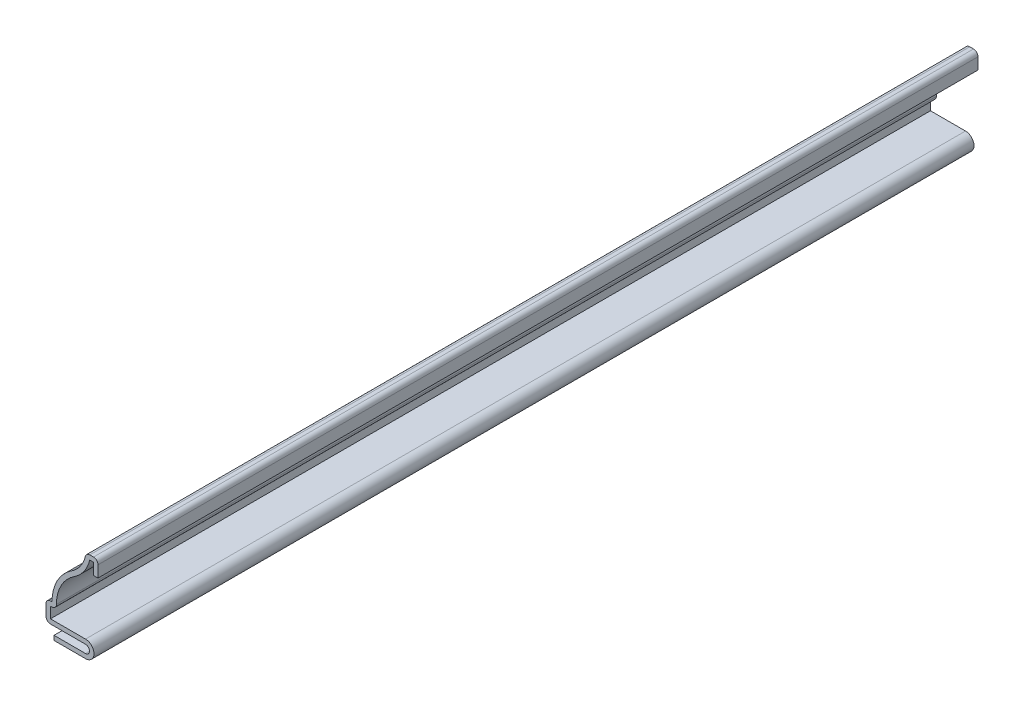
ISO-10303-21;
HEADER;
FILE_DESCRIPTION(('STEP AP214'),'2;1');
FILE_NAME('part.step','',(''),(''),'','','');
FILE_SCHEMA(('AUTOMOTIVE_DESIGN { 1 0 10303 214 1 1 1 1 }'));
ENDSEC;
DATA;
#1=APPLICATION_CONTEXT('core data for automotive mechanical design processes');
#2=APPLICATION_PROTOCOL_DEFINITION('international standard','automotive_design',2000,#1);
#3=PRODUCT_CONTEXT('',#1,'mechanical');
#4=PRODUCT('Part','Part','',(#3));
#5=PRODUCT_RELATED_PRODUCT_CATEGORY('part','',(#4));
#6=PRODUCT_DEFINITION_FORMATION('','',#4);
#7=PRODUCT_DEFINITION_CONTEXT('part definition',#1,'design');
#8=PRODUCT_DEFINITION('design','',#6,#7);
#9=PRODUCT_DEFINITION_SHAPE('','',#8);
#10=(LENGTH_UNIT() NAMED_UNIT(*) SI_UNIT(.MILLI.,.METRE.));
#11=(NAMED_UNIT(*) PLANE_ANGLE_UNIT() SI_UNIT($,.RADIAN.));
#12=(NAMED_UNIT(*) SI_UNIT($,.STERADIAN.) SOLID_ANGLE_UNIT());
#13=UNCERTAINTY_MEASURE_WITH_UNIT(LENGTH_MEASURE(1.E-05),#10,'distance_accuracy_value','');
#14=(GEOMETRIC_REPRESENTATION_CONTEXT(3) GLOBAL_UNCERTAINTY_ASSIGNED_CONTEXT((#13)) GLOBAL_UNIT_ASSIGNED_CONTEXT((#10,
#11,#12)) REPRESENTATION_CONTEXT('',''));
#15=CARTESIAN_POINT('',(0.,0.,0.));
#16=DIRECTION('',(0.,0.,1.));
#17=DIRECTION('',(1.,0.,0.));
#18=AXIS2_PLACEMENT_3D('',#15,#16,#17);
#19=CARTESIAN_POINT('',(-0.889,15.08125,-174.625));
#20=DIRECTION('',(0.,-1.,0.));
#21=DIRECTION('',(0.,0.,-1.));
#22=AXIS2_PLACEMENT_3D('',#19,#20,#21);
#23=PLANE('',#22);
#24=DIRECTION('',(1.,0.,0.));
#25=VECTOR('',#24,1.);
#26=CARTESIAN_POINT('',(-0.889,15.08125,0.));
#27=LINE('',#26,#25);
#28=CARTESIAN_POINT('',(-0.889,15.08125,0.));
#29=VERTEX_POINT('',#28);
#30=CARTESIAN_POINT('',(0.,15.08125,0.));
#31=VERTEX_POINT('',#30);
#32=EDGE_CURVE('E278',#29,#31,#27,.T.);
#33=ORIENTED_EDGE('',*,*,#32,.F.);
#34=DIRECTION('',(0.,0.,1.));
#35=VECTOR('',#34,1.);
#36=CARTESIAN_POINT('',(-0.889,15.08125,-174.625));
#37=LINE('',#36,#35);
#38=CARTESIAN_POINT('',(-0.889,15.08125,-174.625));
#39=VERTEX_POINT('',#38);
#40=EDGE_CURVE('E224',#39,#29,#37,.T.);
#41=ORIENTED_EDGE('',*,*,#40,.F.);
#42=DIRECTION('',(1.,0.,0.));
#43=VECTOR('',#42,1.);
#44=CARTESIAN_POINT('',(-0.889,15.08125,-174.625));
#45=LINE('',#44,#43);
#46=CARTESIAN_POINT('',(0.,15.08125,-174.625));
#47=VERTEX_POINT('',#46);
#48=EDGE_CURVE('E220',#39,#47,#45,.T.);
#49=ORIENTED_EDGE('',*,*,#48,.T.);
#50=DIRECTION('',(0.,0.,1.));
#51=VECTOR('',#50,1.);
#52=CARTESIAN_POINT('',(0.,15.08125,-174.625));
#53=LINE('',#52,#51);
#54=EDGE_CURVE('E203',#47,#31,#53,.T.);
#55=ORIENTED_EDGE('',*,*,#54,.T.);
#56=EDGE_LOOP('',(#33,#41,#49,#55));
#57=FACE_BOUND('',#56,.T.);
#58=ADVANCED_FACE('F35',(#57),#23,.T.);
#59=CARTESIAN_POINT('',(-0.889,15.08125,-174.625));
#60=DIRECTION('',(-1.,0.,0.));
#61=DIRECTION('',(0.,0.,1.));
#62=AXIS2_PLACEMENT_3D('',#59,#60,#61);
#63=PLANE('',#62);
#64=DIRECTION('',(0.,-1.,0.));
#65=VECTOR('',#64,1.);
#66=CARTESIAN_POINT('',(-0.889,15.08125,0.));
#67=LINE('',#66,#65);
#68=CARTESIAN_POINT('',(-0.889,17.36725,0.));
#69=VERTEX_POINT('',#68);
#70=EDGE_CURVE('E225',#69,#29,#67,.T.);
#71=ORIENTED_EDGE('',*,*,#70,.F.);
#72=DIRECTION('',(0.,0.,1.));
#73=VECTOR('',#72,1.);
#74=CARTESIAN_POINT('',(-0.889,17.36725,-174.625));
#75=LINE('',#74,#73);
#76=CARTESIAN_POINT('',(-0.889,17.36725,-174.625));
#77=VERTEX_POINT('',#76);
#78=EDGE_CURVE('E330',#77,#69,#75,.T.);
#79=ORIENTED_EDGE('',*,*,#78,.F.);
#80=DIRECTION('',(0.,-1.,0.));
#81=VECTOR('',#80,1.);
#82=CARTESIAN_POINT('',(-0.889,15.08125,-174.625));
#83=LINE('',#82,#81);
#84=EDGE_CURVE('E214',#77,#39,#83,.T.);
#85=ORIENTED_EDGE('',*,*,#84,.T.);
#86=ORIENTED_EDGE('',*,*,#40,.T.);
#87=EDGE_LOOP('',(#71,#79,#85,#86));
#88=FACE_BOUND('',#87,.T.);
#89=ADVANCED_FACE('F417',(#88),#63,.T.);
#90=CARTESIAN_POINT('',(-0.889,17.36725,-174.625));
#91=DIRECTION('',(0.,-1.,0.));
#92=DIRECTION('',(0.,0.,-1.));
#93=AXIS2_PLACEMENT_3D('',#90,#91,#92);
#94=PLANE('',#93);
#95=DIRECTION('',(1.,0.,0.));
#96=VECTOR('',#95,1.);
#97=CARTESIAN_POINT('',(-0.889,17.36725,0.));
#98=LINE('',#97,#96);
#99=CARTESIAN_POINT('',(-1.64074410593466,17.36725,0.));
#100=VERTEX_POINT('',#99);
#101=EDGE_CURVE('E228',#100,#69,#98,.T.);
#102=ORIENTED_EDGE('',*,*,#101,.F.);
#103=DIRECTION('',(0.,0.,1.));
#104=VECTOR('',#103,1.);
#105=CARTESIAN_POINT('',(-1.64074410593466,17.36725,-174.625));
#106=LINE('',#105,#104);
#107=CARTESIAN_POINT('',(-1.64074410593466,17.36725,-174.625));
#108=VERTEX_POINT('',#107);
#109=EDGE_CURVE('E332',#108,#100,#106,.T.);
#110=ORIENTED_EDGE('',*,*,#109,.F.);
#111=DIRECTION('',(1.,0.,0.));
#112=VECTOR('',#111,1.);
#113=CARTESIAN_POINT('',(-0.889,17.36725,-174.625));
#114=LINE('',#113,#112);
#115=EDGE_CURVE('E274',#108,#77,#114,.T.);
#116=ORIENTED_EDGE('',*,*,#115,.T.);
#117=ORIENTED_EDGE('',*,*,#78,.T.);
#118=EDGE_LOOP('',(#102,#110,#116,#117));
#119=FACE_BOUND('',#118,.T.);
#120=ADVANCED_FACE('F422',(#119),#94,.T.);
#121=CARTESIAN_POINT('',(-8.68144530947256,19.05,-174.625));
#122=DIRECTION('',(0.,0.,1.));
#123=DIRECTION('',(1.,0.,0.));
#124=AXIS2_PLACEMENT_3D('',#121,#122,#123);
#125=CYLINDRICAL_SURFACE('',#124,7.239);
#126=CARTESIAN_POINT('',(-8.68144530947256,19.05,0.));
#127=DIRECTION('',(0.,0.,1.));
#128=DIRECTION('',(-1.,0.,0.));
#129=AXIS2_PLACEMENT_3D('',#126,#127,#128);
#130=CIRCLE('',#129,7.239);
#131=CARTESIAN_POINT('',(-4.70687200890305,12.99972,0.));
#132=VERTEX_POINT('',#131);
#133=EDGE_CURVE('E323',#132,#100,#130,.T.);
#134=ORIENTED_EDGE('',*,*,#133,.F.);
#135=DIRECTION('',(0.,0.,1.));
#136=VECTOR('',#135,1.);
#137=CARTESIAN_POINT('',(-4.70687200890305,12.99972,-174.625));
#138=LINE('',#137,#136);
#139=CARTESIAN_POINT('',(-4.70687200890305,12.99972,-174.625));
#140=VERTEX_POINT('',#139);
#141=EDGE_CURVE('E334',#140,#132,#138,.T.);
#142=ORIENTED_EDGE('',*,*,#141,.F.);
#143=CARTESIAN_POINT('',(-8.68144530947256,19.05,-174.625));
#144=DIRECTION('',(0.,0.,1.));
#145=DIRECTION('',(-1.,0.,0.));
#146=AXIS2_PLACEMENT_3D('',#143,#144,#145);
#147=CIRCLE('',#146,7.239);
#148=EDGE_CURVE('E271',#140,#108,#147,.T.);
#149=ORIENTED_EDGE('',*,*,#148,.T.);
#150=ORIENTED_EDGE('',*,*,#109,.T.);
#151=EDGE_LOOP('',(#134,#142,#149,#150));
#152=FACE_BOUND('',#151,.T.);
#153=ADVANCED_FACE('F520',(#152),#125,.T.);
#154=CARTESIAN_POINT('',(-0.401084266619407,6.44525,-174.625));
#155=DIRECTION('',(0.,0.,1.));
#156=DIRECTION('',(1.,0.,0.));
#157=AXIS2_PLACEMENT_3D('',#154,#155,#156);
#158=CYLINDRICAL_SURFACE('',#157,7.84225);
#159=CARTESIAN_POINT('',(-0.401084266619407,6.44525,0.));
#160=DIRECTION('',(0.,0.,-1.));
#161=DIRECTION('',(1.,0.,0.));
#162=AXIS2_PLACEMENT_3D('',#159,#160,#161);
#163=CIRCLE('',#162,7.84225);
#164=CARTESIAN_POINT('',(-8.2433342666194,6.44525,0.));
#165=VERTEX_POINT('',#164);
#166=EDGE_CURVE('E321',#165,#132,#163,.T.);
#167=ORIENTED_EDGE('',*,*,#166,.F.);
#168=DIRECTION('',(0.,0.,1.));
#169=VECTOR('',#168,1.);
#170=CARTESIAN_POINT('',(-8.2433342666194,6.44525,-174.625));
#171=LINE('',#170,#169);
#172=CARTESIAN_POINT('',(-8.2433342666194,6.44525,-174.625));
#173=VERTEX_POINT('',#172);
#174=EDGE_CURVE('E388',#165,#173,#171,.F.);
#175=ORIENTED_EDGE('',*,*,#174,.T.);
#176=CARTESIAN_POINT('',(-0.401084266619407,6.44525,-174.625));
#177=DIRECTION('',(0.,0.,-1.));
#178=DIRECTION('',(1.,0.,0.));
#179=AXIS2_PLACEMENT_3D('',#176,#177,#178);
#180=CIRCLE('',#179,7.84225);
#181=EDGE_CURVE('E269',#173,#140,#180,.T.);
#182=ORIENTED_EDGE('',*,*,#181,.T.);
#183=ORIENTED_EDGE('',*,*,#141,.T.);
#184=EDGE_LOOP('',(#167,#175,#182,#183));
#185=FACE_BOUND('',#184,.T.);
#186=ADVANCED_FACE('F524',(#185),#158,.F.);
#187=CARTESIAN_POINT('',(-8.1927826734175,5.55625,-174.625));
#188=DIRECTION('',(0.,-1.,0.));
#189=DIRECTION('',(1.,0.,0.));
#190=AXIS2_PLACEMENT_3D('',#187,#188,#189);
#191=PLANE('',#190);
#192=DIRECTION('',(1.,0.,0.));
#193=VECTOR('',#192,1.);
#194=CARTESIAN_POINT('',(-8.1927826734175,5.55625,-174.625));
#195=LINE('',#194,#193);
#196=CARTESIAN_POINT('',(-9.42975,5.55625,-174.625));
#197=VERTEX_POINT('',#196);
#198=CARTESIAN_POINT('',(-9.13233426661941,5.55625,-174.625));
#199=VERTEX_POINT('',#198);
#200=EDGE_CURVE('E266',#197,#199,#195,.T.);
#201=ORIENTED_EDGE('',*,*,#200,.T.);
#202=DIRECTION('',(0.,0.,1.));
#203=VECTOR('',#202,1.);
#204=CARTESIAN_POINT('',(-9.13233426661941,5.55625,-174.625));
#205=LINE('',#204,#203);
#206=CARTESIAN_POINT('',(-9.13233426661941,5.55625,0.));
#207=VERTEX_POINT('',#206);
#208=EDGE_CURVE('E385',#199,#207,#205,.T.);
#209=ORIENTED_EDGE('',*,*,#208,.T.);
#210=DIRECTION('',(1.,0.,0.));
#211=VECTOR('',#210,1.);
#212=CARTESIAN_POINT('',(-8.1927826734175,5.55625,0.));
#213=LINE('',#212,#211);
#214=CARTESIAN_POINT('',(-9.42975,5.55625,0.));
#215=VERTEX_POINT('',#214);
#216=EDGE_CURVE('E318',#215,#207,#213,.T.);
#217=ORIENTED_EDGE('',*,*,#216,.F.);
#218=DIRECTION('',(0.,0.,1.));
#219=VECTOR('',#218,1.);
#220=CARTESIAN_POINT('',(-9.42975,5.55625,-174.625));
#221=LINE('',#220,#219);
#222=EDGE_CURVE('E337',#197,#215,#221,.T.);
#223=ORIENTED_EDGE('',*,*,#222,.F.);
#224=EDGE_LOOP('',(#201,#209,#217,#223));
#225=FACE_BOUND('',#224,.T.);
#226=ADVANCED_FACE('F448',(#225),#191,.T.);
#227=CARTESIAN_POINT('',(-9.42975,5.55625,-174.625));
#228=DIRECTION('',(1.,0.,0.));
#229=DIRECTION('',(0.,0.,-1.));
#230=AXIS2_PLACEMENT_3D('',#227,#228,#229);
#231=PLANE('',#230);
#232=DIRECTION('',(0.,1.,0.));
#233=VECTOR('',#232,1.);
#234=CARTESIAN_POINT('',(-9.42975,5.55625,0.));
#235=LINE('',#234,#233);
#236=CARTESIAN_POINT('',(-9.42975,3.3655,0.));
#237=VERTEX_POINT('',#236);
#238=EDGE_CURVE('E315',#237,#215,#235,.T.);
#239=ORIENTED_EDGE('',*,*,#238,.F.);
#240=DIRECTION('',(0.,0.,1.));
#241=VECTOR('',#240,1.);
#242=CARTESIAN_POINT('',(-9.42975,3.3655,-174.625));
#243=LINE('',#242,#241);
#244=CARTESIAN_POINT('',(-9.42975,3.3655,-174.625));
#245=VERTEX_POINT('',#244);
#246=EDGE_CURVE('E339',#245,#237,#243,.T.);
#247=ORIENTED_EDGE('',*,*,#246,.F.);
#248=DIRECTION('',(0.,1.,0.));
#249=VECTOR('',#248,1.);
#250=CARTESIAN_POINT('',(-9.42975,5.55625,-174.625));
#251=LINE('',#250,#249);
#252=EDGE_CURVE('E263',#245,#197,#251,.T.);
#253=ORIENTED_EDGE('',*,*,#252,.T.);
#254=ORIENTED_EDGE('',*,*,#222,.T.);
#255=EDGE_LOOP('',(#239,#247,#253,#254));
#256=FACE_BOUND('',#255,.T.);
#257=ADVANCED_FACE('F452',(#256),#231,.T.);
#258=CARTESIAN_POINT('',(-9.42975,3.3655,-174.625));
#259=DIRECTION('',(0.,1.,0.));
#260=DIRECTION('',(-1.,0.,0.));
#261=AXIS2_PLACEMENT_3D('',#258,#259,#260);
#262=PLANE('',#261);
#263=DIRECTION('',(-1.,0.,0.));
#264=VECTOR('',#263,1.);
#265=CARTESIAN_POINT('',(-9.42975,3.3655,0.));
#266=LINE('',#265,#264);
#267=CARTESIAN_POINT('',(-2.4765,3.3655,0.));
#268=VERTEX_POINT('',#267);
#269=EDGE_CURVE('E312',#268,#237,#266,.T.);
#270=ORIENTED_EDGE('',*,*,#269,.F.);
#271=DIRECTION('',(0.,0.,1.));
#272=VECTOR('',#271,1.);
#273=CARTESIAN_POINT('',(-2.4765,3.3655,-174.625));
#274=LINE('',#273,#272);
#275=CARTESIAN_POINT('',(-2.4765,3.3655,-174.625));
#276=VERTEX_POINT('',#275);
#277=EDGE_CURVE('E341',#276,#268,#274,.T.);
#278=ORIENTED_EDGE('',*,*,#277,.F.);
#279=DIRECTION('',(-1.,0.,0.));
#280=VECTOR('',#279,1.);
#281=CARTESIAN_POINT('',(-9.42975,3.3655,-174.625));
#282=LINE('',#281,#280);
#283=EDGE_CURVE('E260',#276,#245,#282,.T.);
#284=ORIENTED_EDGE('',*,*,#283,.T.);
#285=ORIENTED_EDGE('',*,*,#246,.T.);
#286=EDGE_LOOP('',(#270,#278,#284,#285));
#287=FACE_BOUND('',#286,.T.);
#288=ADVANCED_FACE('F457',(#287),#262,.T.);
#289=CARTESIAN_POINT('',(-2.4765,1.68275,-174.625));
#290=DIRECTION('',(0.,0.,1.));
#291=DIRECTION('',(1.,0.,0.));
#292=AXIS2_PLACEMENT_3D('',#289,#290,#291);
#293=CYLINDRICAL_SURFACE('',#292,1.68275);
#294=CARTESIAN_POINT('',(-2.4765,1.68275,0.));
#295=DIRECTION('',(0.,0.,1.));
#296=DIRECTION('',(-1.,0.,0.));
#297=AXIS2_PLACEMENT_3D('',#294,#295,#296);
#298=CIRCLE('',#297,1.68275);
#299=CARTESIAN_POINT('',(-2.4765,0.,0.));
#300=VERTEX_POINT('',#299);
#301=EDGE_CURVE('E309',#300,#268,#298,.T.);
#302=ORIENTED_EDGE('',*,*,#301,.F.);
#303=DIRECTION('',(0.,0.,1.));
#304=VECTOR('',#303,1.);
#305=CARTESIAN_POINT('',(-2.4765,0.,-174.625));
#306=LINE('',#305,#304);
#307=CARTESIAN_POINT('',(-2.4765,0.,-174.625));
#308=VERTEX_POINT('',#307);
#309=EDGE_CURVE('E343',#308,#300,#306,.T.);
#310=ORIENTED_EDGE('',*,*,#309,.F.);
#311=CARTESIAN_POINT('',(-2.4765,1.68275,-174.625));
#312=DIRECTION('',(0.,0.,1.));
#313=DIRECTION('',(-1.,0.,0.));
#314=AXIS2_PLACEMENT_3D('',#311,#312,#313);
#315=CIRCLE('',#314,1.68275);
#316=EDGE_CURVE('E257',#308,#276,#315,.T.);
#317=ORIENTED_EDGE('',*,*,#316,.T.);
#318=ORIENTED_EDGE('',*,*,#277,.T.);
#319=EDGE_LOOP('',(#302,#310,#317,#318));
#320=FACE_BOUND('',#319,.T.);
#321=ADVANCED_FACE('F460',(#320),#293,.T.);
#322=CARTESIAN_POINT('',(-2.4765,0.,-174.625));
#323=DIRECTION('',(0.,-1.,0.));
#324=DIRECTION('',(1.,0.,0.));
#325=AXIS2_PLACEMENT_3D('',#322,#323,#324);
#326=PLANE('',#325);
#327=DIRECTION('',(1.,0.,0.));
#328=VECTOR('',#327,1.);
#329=CARTESIAN_POINT('',(-2.4765,0.,0.));
#330=LINE('',#329,#328);
#331=CARTESIAN_POINT('',(-8.73125,0.,0.));
#332=VERTEX_POINT('',#331);
#333=EDGE_CURVE('E306',#332,#300,#330,.T.);
#334=ORIENTED_EDGE('',*,*,#333,.F.);
#335=DIRECTION('',(0.,0.,1.));
#336=VECTOR('',#335,1.);
#337=CARTESIAN_POINT('',(-8.73125,0.,-174.625));
#338=LINE('',#337,#336);
#339=CARTESIAN_POINT('',(-8.73125,0.,-174.625));
#340=VERTEX_POINT('',#339);
#341=EDGE_CURVE('E345',#340,#332,#338,.T.);
#342=ORIENTED_EDGE('',*,*,#341,.F.);
#343=DIRECTION('',(1.,0.,0.));
#344=VECTOR('',#343,1.);
#345=CARTESIAN_POINT('',(-2.4765,0.,-174.625));
#346=LINE('',#345,#344);
#347=EDGE_CURVE('E254',#340,#308,#346,.T.);
#348=ORIENTED_EDGE('',*,*,#347,.T.);
#349=ORIENTED_EDGE('',*,*,#309,.T.);
#350=EDGE_LOOP('',(#334,#342,#348,#349));
#351=FACE_BOUND('',#350,.T.);
#352=ADVANCED_FACE('F465',(#351),#326,.T.);
#353=CARTESIAN_POINT('',(-8.73125,0.,-174.625));
#354=DIRECTION('',(-1.,0.,0.));
#355=DIRECTION('',(0.,0.,1.));
#356=AXIS2_PLACEMENT_3D('',#353,#354,#355);
#357=PLANE('',#356);
#358=DIRECTION('',(0.,-1.,0.));
#359=VECTOR('',#358,1.);
#360=CARTESIAN_POINT('',(-8.73125,0.,0.));
#361=LINE('',#360,#359);
#362=CARTESIAN_POINT('',(-8.73125,0.888999999999999,0.));
#363=VERTEX_POINT('',#362);
#364=EDGE_CURVE('E303',#363,#332,#361,.T.);
#365=ORIENTED_EDGE('',*,*,#364,.F.);
#366=DIRECTION('',(0.,0.,1.));
#367=VECTOR('',#366,1.);
#368=CARTESIAN_POINT('',(-8.73125,0.888999999999999,-174.625));
#369=LINE('',#368,#367);
#370=CARTESIAN_POINT('',(-8.73125,0.888999999999999,-174.625));
#371=VERTEX_POINT('',#370);
#372=EDGE_CURVE('E347',#371,#363,#369,.T.);
#373=ORIENTED_EDGE('',*,*,#372,.F.);
#374=DIRECTION('',(0.,-1.,0.));
#375=VECTOR('',#374,1.);
#376=CARTESIAN_POINT('',(-8.73125,0.,-174.625));
#377=LINE('',#376,#375);
#378=EDGE_CURVE('E251',#371,#340,#377,.T.);
#379=ORIENTED_EDGE('',*,*,#378,.T.);
#380=ORIENTED_EDGE('',*,*,#341,.T.);
#381=EDGE_LOOP('',(#365,#373,#379,#380));
#382=FACE_BOUND('',#381,.T.);
#383=ADVANCED_FACE('F468',(#382),#357,.T.);
#384=CARTESIAN_POINT('',(-2.4765,0.889,-174.625));
#385=DIRECTION('',(0.,1.,0.));
#386=DIRECTION('',(-1.,0.,0.));
#387=AXIS2_PLACEMENT_3D('',#384,#385,#386);
#388=PLANE('',#387);
#389=DIRECTION('',(-1.,0.,0.));
#390=VECTOR('',#389,1.);
#391=CARTESIAN_POINT('',(-2.4765,0.889,0.));
#392=LINE('',#391,#390);
#393=CARTESIAN_POINT('',(-2.4765,0.889,0.));
#394=VERTEX_POINT('',#393);
#395=EDGE_CURVE('E300',#394,#363,#392,.T.);
#396=ORIENTED_EDGE('',*,*,#395,.F.);
#397=DIRECTION('',(0.,0.,1.));
#398=VECTOR('',#397,1.);
#399=CARTESIAN_POINT('',(-2.4765,0.889,-174.625));
#400=LINE('',#399,#398);
#401=CARTESIAN_POINT('',(-2.4765,0.889,-174.625));
#402=VERTEX_POINT('',#401);
#403=EDGE_CURVE('E349',#402,#394,#400,.T.);
#404=ORIENTED_EDGE('',*,*,#403,.F.);
#405=DIRECTION('',(-1.,0.,0.));
#406=VECTOR('',#405,1.);
#407=CARTESIAN_POINT('',(-2.4765,0.889,-174.625));
#408=LINE('',#407,#406);
#409=EDGE_CURVE('E248',#402,#371,#408,.T.);
#410=ORIENTED_EDGE('',*,*,#409,.T.);
#411=ORIENTED_EDGE('',*,*,#372,.T.);
#412=EDGE_LOOP('',(#396,#404,#410,#411));
#413=FACE_BOUND('',#412,.T.);
#414=ADVANCED_FACE('F473',(#413),#388,.T.);
#415=CARTESIAN_POINT('',(-2.4765,1.68275,-174.625));
#416=DIRECTION('',(0.,0.,1.));
#417=DIRECTION('',(1.,0.,0.));
#418=AXIS2_PLACEMENT_3D('',#415,#416,#417);
#419=CYLINDRICAL_SURFACE('',#418,0.793749999999999);
#420=CARTESIAN_POINT('',(-2.4765,1.68275,0.));
#421=DIRECTION('',(0.,0.,-1.));
#422=DIRECTION('',(-1.,0.,0.));
#423=AXIS2_PLACEMENT_3D('',#420,#421,#422);
#424=CIRCLE('',#423,0.793749999999999);
#425=CARTESIAN_POINT('',(-2.4765,2.4765,0.));
#426=VERTEX_POINT('',#425);
#427=EDGE_CURVE('E297',#426,#394,#424,.T.);
#428=ORIENTED_EDGE('',*,*,#427,.F.);
#429=DIRECTION('',(0.,0.,1.));
#430=VECTOR('',#429,1.);
#431=CARTESIAN_POINT('',(-2.4765,2.4765,-174.625));
#432=LINE('',#431,#430);
#433=CARTESIAN_POINT('',(-2.4765,2.4765,-174.625));
#434=VERTEX_POINT('',#433);
#435=EDGE_CURVE('E351',#434,#426,#432,.T.);
#436=ORIENTED_EDGE('',*,*,#435,.F.);
#437=CARTESIAN_POINT('',(-2.4765,1.68275,-174.625));
#438=DIRECTION('',(0.,0.,-1.));
#439=DIRECTION('',(-1.,0.,0.));
#440=AXIS2_PLACEMENT_3D('',#437,#438,#439);
#441=CIRCLE('',#440,0.793749999999999);
#442=EDGE_CURVE('E245',#434,#402,#441,.T.);
#443=ORIENTED_EDGE('',*,*,#442,.T.);
#444=ORIENTED_EDGE('',*,*,#403,.T.);
#445=EDGE_LOOP('',(#428,#436,#443,#444));
#446=FACE_BOUND('',#445,.T.);
#447=ADVANCED_FACE('F476',(#446),#419,.F.);
#448=CARTESIAN_POINT('',(-10.31875,2.4765,-174.625));
#449=DIRECTION('',(0.,-1.,0.));
#450=DIRECTION('',(0.,0.,-1.));
#451=AXIS2_PLACEMENT_3D('',#448,#449,#450);
#452=PLANE('',#451);
#453=DIRECTION('',(1.,0.,0.));
#454=VECTOR('',#453,1.);
#455=CARTESIAN_POINT('',(-10.31875,2.4765,0.));
#456=LINE('',#455,#454);
#457=CARTESIAN_POINT('',(-9.42975,2.4765,0.));
#458=VERTEX_POINT('',#457);
#459=EDGE_CURVE('E295',#458,#426,#456,.T.);
#460=ORIENTED_EDGE('',*,*,#459,.F.);
#461=DIRECTION('',(0.,0.,1.));
#462=VECTOR('',#461,1.);
#463=CARTESIAN_POINT('',(-9.42975,2.4765,-174.625));
#464=LINE('',#463,#462);
#465=CARTESIAN_POINT('',(-9.42975,2.4765,-174.625));
#466=VERTEX_POINT('',#465);
#467=EDGE_CURVE('E372',#458,#466,#464,.F.);
#468=ORIENTED_EDGE('',*,*,#467,.T.);
#469=DIRECTION('',(1.,0.,0.));
#470=VECTOR('',#469,1.);
#471=CARTESIAN_POINT('',(-10.31875,2.4765,-174.625));
#472=LINE('',#471,#470);
#473=EDGE_CURVE('E243',#466,#434,#472,.T.);
#474=ORIENTED_EDGE('',*,*,#473,.T.);
#475=ORIENTED_EDGE('',*,*,#435,.T.);
#476=EDGE_LOOP('',(#460,#468,#474,#475));
#477=FACE_BOUND('',#476,.T.);
#478=ADVANCED_FACE('F545',(#477),#452,.T.);
#479=CARTESIAN_POINT('',(-10.31875,6.44525,-174.625));
#480=DIRECTION('',(-1.,0.,0.));
#481=DIRECTION('',(0.,0.,1.));
#482=AXIS2_PLACEMENT_3D('',#479,#480,#481);
#483=PLANE('',#482);
#484=DIRECTION('',(0.,-1.,0.));
#485=VECTOR('',#484,1.);
#486=CARTESIAN_POINT('',(-10.31875,6.44525,-174.625));
#487=LINE('',#486,#485);
#488=CARTESIAN_POINT('',(-10.31875,5.55625,-174.625));
#489=VERTEX_POINT('',#488);
#490=CARTESIAN_POINT('',(-10.31875,3.3655,-174.625));
#491=VERTEX_POINT('',#490);
#492=EDGE_CURVE('E240',#489,#491,#487,.T.);
#493=ORIENTED_EDGE('',*,*,#492,.T.);
#494=DIRECTION('',(0.,0.,1.));
#495=VECTOR('',#494,1.);
#496=CARTESIAN_POINT('',(-10.31875,3.3655,-174.625));
#497=LINE('',#496,#495);
#498=CARTESIAN_POINT('',(-10.31875,3.3655,0.));
#499=VERTEX_POINT('',#498);
#500=EDGE_CURVE('E359',#491,#499,#497,.T.);
#501=ORIENTED_EDGE('',*,*,#500,.T.);
#502=DIRECTION('',(0.,-1.,0.));
#503=VECTOR('',#502,1.);
#504=CARTESIAN_POINT('',(-10.31875,6.44525,0.));
#505=LINE('',#504,#503);
#506=CARTESIAN_POINT('',(-10.31875,5.55625,0.));
#507=VERTEX_POINT('',#506);
#508=EDGE_CURVE('E292',#507,#499,#505,.T.);
#509=ORIENTED_EDGE('',*,*,#508,.F.);
#510=DIRECTION('',(0.,0.,1.));
#511=VECTOR('',#510,1.);
#512=CARTESIAN_POINT('',(-10.31875,5.55625,-174.625));
#513=LINE('',#512,#511);
#514=EDGE_CURVE('E329',#507,#489,#513,.F.);
#515=ORIENTED_EDGE('',*,*,#514,.T.);
#516=EDGE_LOOP('',(#493,#501,#509,#515));
#517=FACE_BOUND('',#516,.T.);
#518=ADVANCED_FACE('F485',(#517),#483,.T.);
#519=CARTESIAN_POINT('',(-9.13233426661941,6.44525,-174.625));
#520=DIRECTION('',(0.,1.,0.));
#521=DIRECTION('',(0.,0.,1.));
#522=AXIS2_PLACEMENT_3D('',#519,#520,#521);
#523=PLANE('',#522);
#524=DIRECTION('',(-1.,0.,0.));
#525=VECTOR('',#524,1.);
#526=CARTESIAN_POINT('',(-9.13233426661941,6.44525,-174.625));
#527=LINE('',#526,#525);
#528=CARTESIAN_POINT('',(-9.13233426661941,6.44525,-174.625));
#529=VERTEX_POINT('',#528);
#530=CARTESIAN_POINT('',(-9.42975,6.44525,-174.625));
#531=VERTEX_POINT('',#530);
#532=EDGE_CURVE('E237',#529,#531,#527,.T.);
#533=ORIENTED_EDGE('',*,*,#532,.T.);
#534=DIRECTION('',(0.,0.,1.));
#535=VECTOR('',#534,1.);
#536=CARTESIAN_POINT('',(-9.42975,6.44525,-174.625));
#537=LINE('',#536,#535);
#538=CARTESIAN_POINT('',(-9.42975,6.44525,0.));
#539=VERTEX_POINT('',#538);
#540=EDGE_CURVE('E382',#531,#539,#537,.T.);
#541=ORIENTED_EDGE('',*,*,#540,.T.);
#542=DIRECTION('',(-1.,0.,0.));
#543=VECTOR('',#542,1.);
#544=CARTESIAN_POINT('',(-9.13233426661941,6.44525,0.));
#545=LINE('',#544,#543);
#546=CARTESIAN_POINT('',(-9.13233426661941,6.44525,0.));
#547=VERTEX_POINT('',#546);
#548=EDGE_CURVE('E289',#547,#539,#545,.T.);
#549=ORIENTED_EDGE('',*,*,#548,.F.);
#550=DIRECTION('',(0.,0.,1.));
#551=VECTOR('',#550,1.);
#552=CARTESIAN_POINT('',(-9.13233426661941,6.44525,-174.625));
#553=LINE('',#552,#551);
#554=EDGE_CURVE('E354',#529,#547,#553,.T.);
#555=ORIENTED_EDGE('',*,*,#554,.F.);
#556=EDGE_LOOP('',(#533,#541,#549,#555));
#557=FACE_BOUND('',#556,.T.);
#558=ADVANCED_FACE('F492',(#557),#523,.T.);
#559=CARTESIAN_POINT('',(-0.401084266619407,6.44525,-174.625));
#560=DIRECTION('',(0.,0.,1.));
#561=DIRECTION('',(1.,0.,0.));
#562=AXIS2_PLACEMENT_3D('',#559,#560,#561);
#563=CYLINDRICAL_SURFACE('',#562,8.73125);
#564=CARTESIAN_POINT('',(-0.401084266619407,6.44525,0.));
#565=DIRECTION('',(0.,0.,1.));
#566=DIRECTION('',(1.,0.,0.));
#567=AXIS2_PLACEMENT_3D('',#564,#565,#566);
#568=CIRCLE('',#567,8.73125);
#569=CARTESIAN_POINT('',(-5.19497750195544,13.7427368421053,0.));
#570=VERTEX_POINT('',#569);
#571=EDGE_CURVE('E286',#570,#547,#568,.T.);
#572=ORIENTED_EDGE('',*,*,#571,.F.);
#573=DIRECTION('',(0.,0.,1.));
#574=VECTOR('',#573,1.);
#575=CARTESIAN_POINT('',(-5.19497750195544,13.7427368421053,-174.625));
#576=LINE('',#575,#574);
#577=CARTESIAN_POINT('',(-5.19497750195544,13.7427368421053,-174.625));
#578=VERTEX_POINT('',#577);
#579=EDGE_CURVE('E213',#578,#570,#576,.T.);
#580=ORIENTED_EDGE('',*,*,#579,.F.);
#581=CARTESIAN_POINT('',(-0.401084266619407,6.44525,-174.625));
#582=DIRECTION('',(0.,0.,1.));
#583=DIRECTION('',(1.,0.,0.));
#584=AXIS2_PLACEMENT_3D('',#581,#582,#583);
#585=CIRCLE('',#584,8.73125);
#586=EDGE_CURVE('E234',#578,#529,#585,.T.);
#587=ORIENTED_EDGE('',*,*,#586,.T.);
#588=ORIENTED_EDGE('',*,*,#554,.T.);
#589=EDGE_LOOP('',(#572,#580,#587,#588));
#590=FACE_BOUND('',#589,.T.);
#591=ADVANCED_FACE('F495',(#590),#563,.T.);
#592=CARTESIAN_POINT('',(-8.68144530947256,19.05,-174.625));
#593=DIRECTION('',(0.,0.,1.));
#594=DIRECTION('',(1.,0.,0.));
#595=AXIS2_PLACEMENT_3D('',#592,#593,#594);
#596=CYLINDRICAL_SURFACE('',#595,6.35);
#597=CARTESIAN_POINT('',(-8.68144530947256,19.05,0.));
#598=DIRECTION('',(0.,0.,-1.));
#599=DIRECTION('',(-1.,0.,0.));
#600=AXIS2_PLACEMENT_3D('',#597,#598,#599);
#601=CIRCLE('',#600,6.35);
#602=CARTESIAN_POINT('',(-2.50539162215861,17.5739035087719,0.));
#603=VERTEX_POINT('',#602);
#604=EDGE_CURVE('E284',#603,#570,#601,.T.);
#605=ORIENTED_EDGE('',*,*,#604,.F.);
#606=DIRECTION('',(0.,0.,1.));
#607=VECTOR('',#606,1.);
#608=CARTESIAN_POINT('',(-2.50539162215861,17.5739035087719,-174.625));
#609=LINE('',#608,#607);
#610=CARTESIAN_POINT('',(-2.50539162215861,17.5739035087719,-174.625));
#611=VERTEX_POINT('',#610);
#612=EDGE_CURVE('E43',#603,#611,#609,.F.);
#613=ORIENTED_EDGE('',*,*,#612,.T.);
#614=CARTESIAN_POINT('',(-8.68144530947256,19.05,-174.625));
#615=DIRECTION('',(0.,0.,-1.));
#616=DIRECTION('',(-1.,0.,0.));
#617=AXIS2_PLACEMENT_3D('',#614,#615,#616);
#618=CIRCLE('',#617,6.35);
#619=EDGE_CURVE('E232',#611,#578,#618,.T.);
#620=ORIENTED_EDGE('',*,*,#619,.T.);
#621=ORIENTED_EDGE('',*,*,#579,.T.);
#622=EDGE_LOOP('',(#605,#613,#620,#621));
#623=FACE_BOUND('',#622,.T.);
#624=ADVANCED_FACE('F397',(#623),#596,.F.);
#625=CARTESIAN_POINT('',(0.,18.25625,-174.625));
#626=DIRECTION('',(0.,1.,0.));
#627=DIRECTION('',(0.,0.,1.));
#628=AXIS2_PLACEMENT_3D('',#625,#626,#627);
#629=PLANE('',#628);
#630=DIRECTION('',(-1.,0.,0.));
#631=VECTOR('',#630,1.);
#632=CARTESIAN_POINT('',(0.,18.25625,-174.625));
#633=LINE('',#632,#631);
#634=CARTESIAN_POINT('',(-0.889,18.25625,-174.625));
#635=VERTEX_POINT('',#634);
#636=CARTESIAN_POINT('',(-1.64074410593466,18.25625,-174.625));
#637=VERTEX_POINT('',#636);
#638=EDGE_CURVE('E222',#635,#637,#633,.T.);
#639=ORIENTED_EDGE('',*,*,#638,.T.);
#640=DIRECTION('',(0.,0.,1.));
#641=VECTOR('',#640,1.);
#642=CARTESIAN_POINT('',(-1.64074410593466,18.25625,-174.625));
#643=LINE('',#642,#641);
#644=CARTESIAN_POINT('',(-1.64074410593466,18.25625,0.));
#645=VERTEX_POINT('',#644);
#646=EDGE_CURVE('E392',#637,#645,#643,.T.);
#647=ORIENTED_EDGE('',*,*,#646,.T.);
#648=DIRECTION('',(-1.,0.,0.));
#649=VECTOR('',#648,1.);
#650=CARTESIAN_POINT('',(0.,18.25625,0.));
#651=LINE('',#650,#649);
#652=CARTESIAN_POINT('',(-0.889,18.25625,0.));
#653=VERTEX_POINT('',#652);
#654=EDGE_CURVE('E281',#653,#645,#651,.T.);
#655=ORIENTED_EDGE('',*,*,#654,.F.);
#656=DIRECTION('',(0.,0.,1.));
#657=VECTOR('',#656,1.);
#658=CARTESIAN_POINT('',(-0.889,18.25625,-174.625));
#659=LINE('',#658,#657);
#660=EDGE_CURVE('E390',#653,#635,#659,.F.);
#661=ORIENTED_EDGE('',*,*,#660,.T.);
#662=EDGE_LOOP('',(#639,#647,#655,#661));
#663=FACE_BOUND('',#662,.T.);
#664=ADVANCED_FACE('F406',(#663),#629,.T.);
#665=CARTESIAN_POINT('',(0.,15.08125,-174.625));
#666=DIRECTION('',(1.,0.,0.));
#667=DIRECTION('',(0.,0.,-1.));
#668=AXIS2_PLACEMENT_3D('',#665,#666,#667);
#669=PLANE('',#668);
#670=DIRECTION('',(0.,1.,0.));
#671=VECTOR('',#670,1.);
#672=CARTESIAN_POINT('',(0.,15.08125,-174.625));
#673=LINE('',#672,#671);
#674=CARTESIAN_POINT('',(0.,17.36725,-174.625));
#675=VERTEX_POINT('',#674);
#676=EDGE_CURVE('E205',#47,#675,#673,.T.);
#677=ORIENTED_EDGE('',*,*,#676,.T.);
#678=DIRECTION('',(0.,0.,1.));
#679=VECTOR('',#678,1.);
#680=CARTESIAN_POINT('',(0.,17.36725,-174.625));
#681=LINE('',#680,#679);
#682=CARTESIAN_POINT('',(0.,17.36725,0.));
#683=VERTEX_POINT('',#682);
#684=EDGE_CURVE('E11',#675,#683,#681,.T.);
#685=ORIENTED_EDGE('',*,*,#684,.T.);
#686=DIRECTION('',(0.,1.,0.));
#687=VECTOR('',#686,1.);
#688=CARTESIAN_POINT('',(0.,15.08125,0.));
#689=LINE('',#688,#687);
#690=EDGE_CURVE('E208',#31,#683,#689,.T.);
#691=ORIENTED_EDGE('',*,*,#690,.F.);
#692=ORIENTED_EDGE('',*,*,#54,.F.);
#693=EDGE_LOOP('',(#677,#685,#691,#692));
#694=FACE_BOUND('',#693,.T.);
#695=ADVANCED_FACE('F204',(#694),#669,.T.);
#696=CARTESIAN_POINT('',(-8.68144530947256,19.05,-174.625));
#697=DIRECTION('',(0.,0.,-1.));
#698=DIRECTION('',(-1.,0.,0.));
#699=AXIS2_PLACEMENT_3D('',#696,#697,#698);
#700=PLANE('',#699);
#701=ORIENTED_EDGE('',*,*,#473,.F.);
#702=CARTESIAN_POINT('',(-9.42975,3.3655,-174.625));
#703=DIRECTION('',(0.,0.,-1.));
#704=DIRECTION('',(-1.,0.,0.));
#705=AXIS2_PLACEMENT_3D('',#702,#703,#704);
#706=CIRCLE('',#705,0.889);
#707=EDGE_CURVE('E380',#466,#491,#706,.T.);
#708=ORIENTED_EDGE('',*,*,#707,.T.);
#709=ORIENTED_EDGE('',*,*,#492,.F.);
#710=CARTESIAN_POINT('',(-9.42975,5.55625,-174.625));
#711=DIRECTION('',(0.,0.,-1.));
#712=DIRECTION('',(-1.,0.,0.));
#713=AXIS2_PLACEMENT_3D('',#710,#711,#712);
#714=CIRCLE('',#713,0.889);
#715=EDGE_CURVE('E378',#489,#531,#714,.T.);
#716=ORIENTED_EDGE('',*,*,#715,.T.);
#717=ORIENTED_EDGE('',*,*,#532,.F.);
#718=ORIENTED_EDGE('',*,*,#586,.F.);
#719=ORIENTED_EDGE('',*,*,#619,.F.);
#720=CARTESIAN_POINT('',(-1.64074410593466,17.36725,-174.625));
#721=DIRECTION('',(0.,0.,-1.));
#722=DIRECTION('',(-1.,0.,0.));
#723=AXIS2_PLACEMENT_3D('',#720,#721,#722);
#724=CIRCLE('',#723,0.889);
#725=EDGE_CURVE('E56',#611,#637,#724,.T.);
#726=ORIENTED_EDGE('',*,*,#725,.T.);
#727=ORIENTED_EDGE('',*,*,#638,.F.);
#728=CARTESIAN_POINT('',(-0.889,17.36725,-174.625));
#729=DIRECTION('',(0.,0.,-1.));
#730=DIRECTION('',(-1.,0.,0.));
#731=AXIS2_PLACEMENT_3D('',#728,#729,#730);
#732=CIRCLE('',#731,0.889);
#733=EDGE_CURVE('E50',#635,#675,#732,.T.);
#734=ORIENTED_EDGE('',*,*,#733,.T.);
#735=ORIENTED_EDGE('',*,*,#676,.F.);
#736=ORIENTED_EDGE('',*,*,#48,.F.);
#737=ORIENTED_EDGE('',*,*,#84,.F.);
#738=ORIENTED_EDGE('',*,*,#115,.F.);
#739=ORIENTED_EDGE('',*,*,#148,.F.);
#740=ORIENTED_EDGE('',*,*,#181,.F.);
#741=CARTESIAN_POINT('',(-9.13233426661941,6.44525,-174.625));
#742=DIRECTION('',(0.,0.,-1.));
#743=DIRECTION('',(-1.,0.,0.));
#744=AXIS2_PLACEMENT_3D('',#741,#742,#743);
#745=CIRCLE('',#744,0.889);
#746=EDGE_CURVE('E376',#173,#199,#745,.T.);
#747=ORIENTED_EDGE('',*,*,#746,.T.);
#748=ORIENTED_EDGE('',*,*,#200,.F.);
#749=ORIENTED_EDGE('',*,*,#252,.F.);
#750=ORIENTED_EDGE('',*,*,#283,.F.);
#751=ORIENTED_EDGE('',*,*,#316,.F.);
#752=ORIENTED_EDGE('',*,*,#347,.F.);
#753=ORIENTED_EDGE('',*,*,#378,.F.);
#754=ORIENTED_EDGE('',*,*,#409,.F.);
#755=ORIENTED_EDGE('',*,*,#442,.F.);
#756=EDGE_LOOP('',(#701,#708,#709,#716,#717,#718,#719,#726,#727,#734,#735,#736,#737,#738,#739,
#740,#747,#748,#749,#750,#751,#752,#753,#754,#755));
#757=FACE_BOUND('',#756,.T.);
#758=ADVANCED_FACE('F218',(#757),#700,.T.);
#759=CARTESIAN_POINT('',(-8.68144530947256,19.05,0.));
#760=DIRECTION('',(0.,0.,-1.));
#761=DIRECTION('',(-1.,0.,0.));
#762=AXIS2_PLACEMENT_3D('',#759,#760,#761);
#763=PLANE('',#762);
#764=ORIENTED_EDGE('',*,*,#508,.T.);
#765=CARTESIAN_POINT('',(-9.42975,3.3655,0.));
#766=DIRECTION('',(0.,0.,-1.));
#767=DIRECTION('',(-1.,0.,0.));
#768=AXIS2_PLACEMENT_3D('',#765,#766,#767);
#769=CIRCLE('',#768,0.889);
#770=EDGE_CURVE('E370',#499,#458,#769,.F.);
#771=ORIENTED_EDGE('',*,*,#770,.T.);
#772=ORIENTED_EDGE('',*,*,#459,.T.);
#773=ORIENTED_EDGE('',*,*,#427,.T.);
#774=ORIENTED_EDGE('',*,*,#395,.T.);
#775=ORIENTED_EDGE('',*,*,#364,.T.);
#776=ORIENTED_EDGE('',*,*,#333,.T.);
#777=ORIENTED_EDGE('',*,*,#301,.T.);
#778=ORIENTED_EDGE('',*,*,#269,.T.);
#779=ORIENTED_EDGE('',*,*,#238,.T.);
#780=ORIENTED_EDGE('',*,*,#216,.T.);
#781=CARTESIAN_POINT('',(-9.13233426661941,6.44525,0.));
#782=DIRECTION('',(0.,0.,-1.));
#783=DIRECTION('',(-1.,0.,0.));
#784=AXIS2_PLACEMENT_3D('',#781,#782,#783);
#785=CIRCLE('',#784,0.889);
#786=EDGE_CURVE('E366',#207,#165,#785,.F.);
#787=ORIENTED_EDGE('',*,*,#786,.T.);
#788=ORIENTED_EDGE('',*,*,#166,.T.);
#789=ORIENTED_EDGE('',*,*,#133,.T.);
#790=ORIENTED_EDGE('',*,*,#101,.T.);
#791=ORIENTED_EDGE('',*,*,#70,.T.);
#792=ORIENTED_EDGE('',*,*,#32,.T.);
#793=ORIENTED_EDGE('',*,*,#690,.T.);
#794=CARTESIAN_POINT('',(-0.889,17.36725,0.));
#795=DIRECTION('',(0.,0.,-1.));
#796=DIRECTION('',(-1.,0.,0.));
#797=AXIS2_PLACEMENT_3D('',#794,#795,#796);
#798=CIRCLE('',#797,0.889);
#799=EDGE_CURVE('E362',#683,#653,#798,.F.);
#800=ORIENTED_EDGE('',*,*,#799,.T.);
#801=ORIENTED_EDGE('',*,*,#654,.T.);
#802=CARTESIAN_POINT('',(-1.64074410593466,17.36725,0.));
#803=DIRECTION('',(0.,0.,-1.));
#804=DIRECTION('',(-1.,0.,0.));
#805=AXIS2_PLACEMENT_3D('',#802,#803,#804);
#806=CIRCLE('',#805,0.889);
#807=EDGE_CURVE('E364',#645,#603,#806,.F.);
#808=ORIENTED_EDGE('',*,*,#807,.T.);
#809=ORIENTED_EDGE('',*,*,#604,.T.);
#810=ORIENTED_EDGE('',*,*,#571,.T.);
#811=ORIENTED_EDGE('',*,*,#548,.T.);
#812=CARTESIAN_POINT('',(-9.42975,5.55625,0.));
#813=DIRECTION('',(0.,0.,-1.));
#814=DIRECTION('',(-1.,0.,0.));
#815=AXIS2_PLACEMENT_3D('',#812,#813,#814);
#816=CIRCLE('',#815,0.889);
#817=EDGE_CURVE('E368',#539,#507,#816,.F.);
#818=ORIENTED_EDGE('',*,*,#817,.T.);
#819=EDGE_LOOP('',(#764,#771,#772,#773,#774,#775,#776,#777,#778,#779,#780,#787,#788,#789,#790,
#791,#792,#793,#800,#801,#808,#809,#810,#811,#818));
#820=FACE_BOUND('',#819,.T.);
#821=ADVANCED_FACE('F409',(#820),#763,.F.);
#822=CARTESIAN_POINT('',(-9.42975,3.3655,-174.625));
#823=DIRECTION('',(0.,0.,1.));
#824=DIRECTION('',(1.,0.,0.));
#825=AXIS2_PLACEMENT_3D('',#822,#823,#824);
#826=CYLINDRICAL_SURFACE('',#825,0.889);
#827=ORIENTED_EDGE('',*,*,#707,.F.);
#828=ORIENTED_EDGE('',*,*,#467,.F.);
#829=ORIENTED_EDGE('',*,*,#770,.F.);
#830=ORIENTED_EDGE('',*,*,#500,.F.);
#831=EDGE_LOOP('',(#827,#828,#829,#830));
#832=FACE_BOUND('',#831,.T.);
#833=ADVANCED_FACE('F428',(#832),#826,.T.);
#834=CARTESIAN_POINT('',(-9.42975,5.55625,-174.625));
#835=DIRECTION('',(0.,0.,1.));
#836=DIRECTION('',(1.,0.,0.));
#837=AXIS2_PLACEMENT_3D('',#834,#835,#836);
#838=CYLINDRICAL_SURFACE('',#837,0.889);
#839=ORIENTED_EDGE('',*,*,#715,.F.);
#840=ORIENTED_EDGE('',*,*,#514,.F.);
#841=ORIENTED_EDGE('',*,*,#817,.F.);
#842=ORIENTED_EDGE('',*,*,#540,.F.);
#843=EDGE_LOOP('',(#839,#840,#841,#842));
#844=FACE_BOUND('',#843,.T.);
#845=ADVANCED_FACE('F431',(#844),#838,.T.);
#846=CARTESIAN_POINT('',(-9.13233426661941,6.44525,-174.625));
#847=DIRECTION('',(0.,0.,1.));
#848=DIRECTION('',(1.,0.,0.));
#849=AXIS2_PLACEMENT_3D('',#846,#847,#848);
#850=CYLINDRICAL_SURFACE('',#849,0.889);
#851=ORIENTED_EDGE('',*,*,#746,.F.);
#852=ORIENTED_EDGE('',*,*,#174,.F.);
#853=ORIENTED_EDGE('',*,*,#786,.F.);
#854=ORIENTED_EDGE('',*,*,#208,.F.);
#855=EDGE_LOOP('',(#851,#852,#853,#854));
#856=FACE_BOUND('',#855,.T.);
#857=ADVANCED_FACE('F415',(#856),#850,.T.);
#858=CARTESIAN_POINT('',(-1.64074410593466,17.36725,-174.625));
#859=DIRECTION('',(0.,0.,1.));
#860=DIRECTION('',(1.,0.,0.));
#861=AXIS2_PLACEMENT_3D('',#858,#859,#860);
#862=CYLINDRICAL_SURFACE('',#861,0.889);
#863=ORIENTED_EDGE('',*,*,#725,.F.);
#864=ORIENTED_EDGE('',*,*,#612,.F.);
#865=ORIENTED_EDGE('',*,*,#807,.F.);
#866=ORIENTED_EDGE('',*,*,#646,.F.);
#867=EDGE_LOOP('',(#863,#864,#865,#866));
#868=FACE_BOUND('',#867,.T.);
#869=ADVANCED_FACE('F403',(#868),#862,.T.);
#870=CARTESIAN_POINT('',(-0.889,17.36725,-174.625));
#871=DIRECTION('',(0.,0.,1.));
#872=DIRECTION('',(1.,0.,0.));
#873=AXIS2_PLACEMENT_3D('',#870,#871,#872);
#874=CYLINDRICAL_SURFACE('',#873,0.889);
#875=ORIENTED_EDGE('',*,*,#733,.F.);
#876=ORIENTED_EDGE('',*,*,#660,.F.);
#877=ORIENTED_EDGE('',*,*,#799,.F.);
#878=ORIENTED_EDGE('',*,*,#684,.F.);
#879=EDGE_LOOP('',(#875,#876,#877,#878));
#880=FACE_BOUND('',#879,.T.);
#881=ADVANCED_FACE('F37',(#880),#874,.T.);
#882=CLOSED_SHELL('',(#58,#89,#120,#153,#186,#226,#257,#288,#321,#352,#383,#414,#447,#478,#518,
#558,#591,#624,#664,#695,#758,#821,#833,#845,#857,#869,#881));
#883=MANIFOLD_SOLID_BREP('B2',#882);
#884=ADVANCED_BREP_SHAPE_REPRESENTATION('',(#18,#883),#14);
#885=SHAPE_DEFINITION_REPRESENTATION(#9,#884);
ENDSEC;
END-ISO-10303-21;
